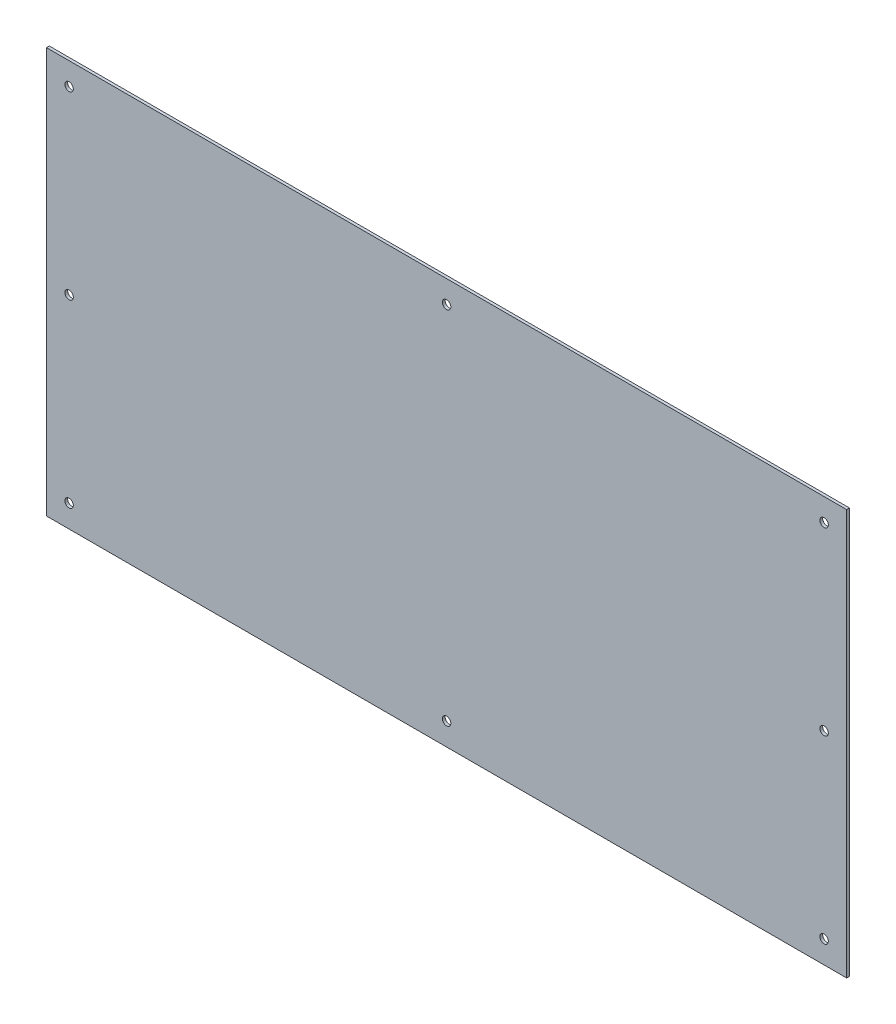
ISO-10303-21;
HEADER;
FILE_DESCRIPTION(('STEP AP214'),'2;1');
FILE_NAME('part.step','',(''),(''),'','','');
FILE_SCHEMA(('AUTOMOTIVE_DESIGN { 1 0 10303 214 1 1 1 1 }'));
ENDSEC;
DATA;
#1=APPLICATION_CONTEXT('core data for automotive mechanical design processes');
#2=APPLICATION_PROTOCOL_DEFINITION('international standard','automotive_design',2000,#1);
#3=PRODUCT_CONTEXT('',#1,'mechanical');
#4=PRODUCT('Part','Part','',(#3));
#5=PRODUCT_RELATED_PRODUCT_CATEGORY('part','',(#4));
#6=PRODUCT_DEFINITION_FORMATION('','',#4);
#7=PRODUCT_DEFINITION_CONTEXT('part definition',#1,'design');
#8=PRODUCT_DEFINITION('design','',#6,#7);
#9=PRODUCT_DEFINITION_SHAPE('','',#8);
#10=(LENGTH_UNIT() NAMED_UNIT(*) SI_UNIT(.MILLI.,.METRE.));
#11=(NAMED_UNIT(*) PLANE_ANGLE_UNIT() SI_UNIT($,.RADIAN.));
#12=(NAMED_UNIT(*) SI_UNIT($,.STERADIAN.) SOLID_ANGLE_UNIT());
#13=UNCERTAINTY_MEASURE_WITH_UNIT(LENGTH_MEASURE(1.E-05),#10,'distance_accuracy_value','');
#14=(GEOMETRIC_REPRESENTATION_CONTEXT(3) GLOBAL_UNCERTAINTY_ASSIGNED_CONTEXT((#13)) GLOBAL_UNIT_ASSIGNED_CONTEXT((#10,
#11,#12)) REPRESENTATION_CONTEXT('',''));
#15=CARTESIAN_POINT('',(0.,0.,0.));
#16=DIRECTION('',(0.,0.,1.));
#17=DIRECTION('',(1.,0.,0.));
#18=AXIS2_PLACEMENT_3D('',#15,#16,#17);
#19=CARTESIAN_POINT('',(0.,0.,3.175));
#20=DIRECTION('',(0.,0.,1.));
#21=DIRECTION('',(1.,0.,0.));
#22=AXIS2_PLACEMENT_3D('',#19,#20,#21);
#23=PLANE('',#22);
#24=CARTESIAN_POINT('',(425.45,203.2,3.175));
#25=DIRECTION('',(0.,0.,1.));
#26=DIRECTION('',(1.,0.,0.));
#27=AXIS2_PLACEMENT_3D('',#24,#25,#26);
#28=CIRCLE('',#27,4.7625);
#29=CARTESIAN_POINT('',(430.2125,203.2,3.175));
#30=VERTEX_POINT('',#29);
#31=EDGE_CURVE('E104',#30,#30,#28,.F.);
#32=ORIENTED_EDGE('',*,*,#31,.T.);
#33=EDGE_LOOP('',(#32));
#34=FACE_BOUND('',#33,.T.);
#35=CARTESIAN_POINT('',(425.45,0.,3.175));
#36=DIRECTION('',(0.,0.,1.));
#37=DIRECTION('',(1.,0.,0.));
#38=AXIS2_PLACEMENT_3D('',#35,#36,#37);
#39=CIRCLE('',#38,4.7625);
#40=CARTESIAN_POINT('',(430.2125,0.,3.175));
#41=VERTEX_POINT('',#40);
#42=EDGE_CURVE('E107',#41,#41,#39,.F.);
#43=ORIENTED_EDGE('',*,*,#42,.T.);
#44=EDGE_LOOP('',(#43));
#45=FACE_BOUND('',#44,.T.);
#46=CARTESIAN_POINT('',(425.45,-203.2,3.175));
#47=DIRECTION('',(0.,0.,1.));
#48=DIRECTION('',(1.,0.,0.));
#49=AXIS2_PLACEMENT_3D('',#46,#47,#48);
#50=CIRCLE('',#49,4.7625);
#51=CARTESIAN_POINT('',(430.2125,-203.2,3.175));
#52=VERTEX_POINT('',#51);
#53=EDGE_CURVE('E110',#52,#52,#50,.F.);
#54=ORIENTED_EDGE('',*,*,#53,.T.);
#55=EDGE_LOOP('',(#54));
#56=FACE_BOUND('',#55,.T.);
#57=CARTESIAN_POINT('',(0.,-203.2,3.175));
#58=DIRECTION('',(0.,0.,1.));
#59=DIRECTION('',(1.,0.,0.));
#60=AXIS2_PLACEMENT_3D('',#57,#58,#59);
#61=CIRCLE('',#60,4.7625);
#62=CARTESIAN_POINT('',(4.7625,-203.2,3.175));
#63=VERTEX_POINT('',#62);
#64=EDGE_CURVE('E113',#63,#63,#61,.F.);
#65=ORIENTED_EDGE('',*,*,#64,.T.);
#66=EDGE_LOOP('',(#65));
#67=FACE_BOUND('',#66,.T.);
#68=CARTESIAN_POINT('',(0.,203.2,3.175));
#69=DIRECTION('',(0.,0.,-1.));
#70=DIRECTION('',(-1.,0.,0.));
#71=AXIS2_PLACEMENT_3D('',#68,#69,#70);
#72=CIRCLE('',#71,4.7625);
#73=CARTESIAN_POINT('',(-4.7625,203.2,3.175));
#74=VERTEX_POINT('',#73);
#75=EDGE_CURVE('E116',#74,#74,#72,.T.);
#76=ORIENTED_EDGE('',*,*,#75,.T.);
#77=EDGE_LOOP('',(#76));
#78=FACE_BOUND('',#77,.T.);
#79=CARTESIAN_POINT('',(-425.45,203.2,3.175));
#80=DIRECTION('',(0.,0.,-1.));
#81=DIRECTION('',(-1.,0.,0.));
#82=AXIS2_PLACEMENT_3D('',#79,#80,#81);
#83=CIRCLE('',#82,4.7625);
#84=CARTESIAN_POINT('',(-430.2125,203.2,3.175));
#85=VERTEX_POINT('',#84);
#86=EDGE_CURVE('E119',#85,#85,#83,.T.);
#87=ORIENTED_EDGE('',*,*,#86,.T.);
#88=EDGE_LOOP('',(#87));
#89=FACE_BOUND('',#88,.T.);
#90=CARTESIAN_POINT('',(-425.45,0.,3.175));
#91=DIRECTION('',(0.,0.,-1.));
#92=DIRECTION('',(-1.,0.,0.));
#93=AXIS2_PLACEMENT_3D('',#90,#91,#92);
#94=CIRCLE('',#93,4.7625);
#95=CARTESIAN_POINT('',(-430.2125,0.,3.175));
#96=VERTEX_POINT('',#95);
#97=EDGE_CURVE('E121',#96,#96,#94,.T.);
#98=ORIENTED_EDGE('',*,*,#97,.T.);
#99=EDGE_LOOP('',(#98));
#100=FACE_BOUND('',#99,.T.);
#101=CARTESIAN_POINT('',(-425.45,-203.2,3.175));
#102=DIRECTION('',(0.,0.,-1.));
#103=DIRECTION('',(-1.,0.,0.));
#104=AXIS2_PLACEMENT_3D('',#101,#102,#103);
#105=CIRCLE('',#104,4.7625);
#106=CARTESIAN_POINT('',(-430.2125,-203.2,3.175));
#107=VERTEX_POINT('',#106);
#108=EDGE_CURVE('E20',#107,#107,#105,.T.);
#109=ORIENTED_EDGE('',*,*,#108,.T.);
#110=EDGE_LOOP('',(#109));
#111=FACE_BOUND('',#110,.T.);
#112=DIRECTION('',(1.,0.,0.));
#113=VECTOR('',#112,1.);
#114=CARTESIAN_POINT('',(450.85,228.6,3.175));
#115=LINE('',#114,#113);
#116=CARTESIAN_POINT('',(-450.85,228.6,3.175));
#117=VERTEX_POINT('',#116);
#118=CARTESIAN_POINT('',(450.85,228.6,3.175));
#119=VERTEX_POINT('',#118);
#120=EDGE_CURVE('E71',#117,#119,#115,.T.);
#121=ORIENTED_EDGE('',*,*,#120,.F.);
#122=DIRECTION('',(0.,1.,0.));
#123=VECTOR('',#122,1.);
#124=CARTESIAN_POINT('',(-450.85,228.6,3.175));
#125=LINE('',#124,#123);
#126=CARTESIAN_POINT('',(-450.85,-228.6,3.175));
#127=VERTEX_POINT('',#126);
#128=EDGE_CURVE('E68',#127,#117,#125,.T.);
#129=ORIENTED_EDGE('',*,*,#128,.F.);
#130=DIRECTION('',(1.,0.,0.));
#131=VECTOR('',#130,1.);
#132=CARTESIAN_POINT('',(-450.85,-228.6,3.175));
#133=LINE('',#132,#131);
#134=CARTESIAN_POINT('',(450.85,-228.6,3.175));
#135=VERTEX_POINT('',#134);
#136=EDGE_CURVE('E59',#135,#127,#133,.F.);
#137=ORIENTED_EDGE('',*,*,#136,.F.);
#138=DIRECTION('',(0.,1.,0.));
#139=VECTOR('',#138,1.);
#140=CARTESIAN_POINT('',(450.85,-228.6,3.175));
#141=LINE('',#140,#139);
#142=EDGE_CURVE('E54',#119,#135,#141,.F.);
#143=ORIENTED_EDGE('',*,*,#142,.F.);
#144=EDGE_LOOP('',(#121,#129,#137,#143));
#145=FACE_BOUND('',#144,.T.);
#146=ADVANCED_FACE('F17',(#34,#45,#56,#67,#78,#89,#100,#111,#145),#23,.T.);
#147=CARTESIAN_POINT('',(-450.85,228.6,0.));
#148=DIRECTION('',(-1.,0.,0.));
#149=DIRECTION('',(0.,0.,1.));
#150=AXIS2_PLACEMENT_3D('',#147,#148,#149);
#151=PLANE('',#150);
#152=DIRECTION('',(0.,0.,1.));
#153=VECTOR('',#152,1.);
#154=CARTESIAN_POINT('',(-450.85,228.6,0.));
#155=LINE('',#154,#153);
#156=CARTESIAN_POINT('',(-450.85,228.6,0.));
#157=VERTEX_POINT('',#156);
#158=EDGE_CURVE('E129',#157,#117,#155,.T.);
#159=ORIENTED_EDGE('',*,*,#158,.F.);
#160=DIRECTION('',(0.,1.,0.));
#161=VECTOR('',#160,1.);
#162=CARTESIAN_POINT('',(-450.85,0.,0.));
#163=LINE('',#162,#161);
#164=CARTESIAN_POINT('',(-450.85,-228.6,0.));
#165=VERTEX_POINT('',#164);
#166=EDGE_CURVE('E78',#157,#165,#163,.F.);
#167=ORIENTED_EDGE('',*,*,#166,.T.);
#168=DIRECTION('',(0.,0.,-1.));
#169=VECTOR('',#168,1.);
#170=CARTESIAN_POINT('',(-450.85,-228.6,0.));
#171=LINE('',#170,#169);
#172=EDGE_CURVE('E64',#127,#165,#171,.T.);
#173=ORIENTED_EDGE('',*,*,#172,.F.);
#174=ORIENTED_EDGE('',*,*,#128,.T.);
#175=EDGE_LOOP('',(#159,#167,#173,#174));
#176=FACE_BOUND('',#175,.T.);
#177=ADVANCED_FACE('F77',(#176),#151,.T.);
#178=CARTESIAN_POINT('',(-450.85,-228.6,0.));
#179=DIRECTION('',(0.,-1.,0.));
#180=DIRECTION('',(0.,0.,-1.));
#181=AXIS2_PLACEMENT_3D('',#178,#179,#180);
#182=PLANE('',#181);
#183=ORIENTED_EDGE('',*,*,#172,.T.);
#184=DIRECTION('',(1.,0.,0.));
#185=VECTOR('',#184,1.);
#186=CARTESIAN_POINT('',(0.,-228.6,0.));
#187=LINE('',#186,#185);
#188=CARTESIAN_POINT('',(450.85,-228.6,0.));
#189=VERTEX_POINT('',#188);
#190=EDGE_CURVE('E140',#165,#189,#187,.T.);
#191=ORIENTED_EDGE('',*,*,#190,.T.);
#192=DIRECTION('',(0.,0.,-1.));
#193=VECTOR('',#192,1.);
#194=CARTESIAN_POINT('',(450.85,-228.6,0.));
#195=LINE('',#194,#193);
#196=EDGE_CURVE('E66',#135,#189,#195,.T.);
#197=ORIENTED_EDGE('',*,*,#196,.F.);
#198=ORIENTED_EDGE('',*,*,#136,.T.);
#199=EDGE_LOOP('',(#183,#191,#197,#198));
#200=FACE_BOUND('',#199,.T.);
#201=ADVANCED_FACE('F61',(#200),#182,.T.);
#202=CARTESIAN_POINT('',(450.85,-228.6,0.));
#203=DIRECTION('',(1.,0.,0.));
#204=DIRECTION('',(0.,0.,-1.));
#205=AXIS2_PLACEMENT_3D('',#202,#203,#204);
#206=PLANE('',#205);
#207=ORIENTED_EDGE('',*,*,#196,.T.);
#208=DIRECTION('',(0.,1.,0.));
#209=VECTOR('',#208,1.);
#210=CARTESIAN_POINT('',(450.85,0.,0.));
#211=LINE('',#210,#209);
#212=CARTESIAN_POINT('',(450.85,228.6,0.));
#213=VERTEX_POINT('',#212);
#214=EDGE_CURVE('E137',#189,#213,#211,.T.);
#215=ORIENTED_EDGE('',*,*,#214,.T.);
#216=DIRECTION('',(0.,0.,1.));
#217=VECTOR('',#216,1.);
#218=CARTESIAN_POINT('',(450.85,228.6,0.));
#219=LINE('',#218,#217);
#220=EDGE_CURVE('E35',#119,#213,#219,.F.);
#221=ORIENTED_EDGE('',*,*,#220,.F.);
#222=ORIENTED_EDGE('',*,*,#142,.T.);
#223=EDGE_LOOP('',(#207,#215,#221,#222));
#224=FACE_BOUND('',#223,.T.);
#225=ADVANCED_FACE('F136',(#224),#206,.T.);
#226=CARTESIAN_POINT('',(450.85,228.6,0.));
#227=DIRECTION('',(0.,1.,0.));
#228=DIRECTION('',(0.,0.,1.));
#229=AXIS2_PLACEMENT_3D('',#226,#227,#228);
#230=PLANE('',#229);
#231=ORIENTED_EDGE('',*,*,#220,.T.);
#232=DIRECTION('',(1.,0.,0.));
#233=VECTOR('',#232,1.);
#234=CARTESIAN_POINT('',(0.,228.6,0.));
#235=LINE('',#234,#233);
#236=EDGE_CURVE('E103',#213,#157,#235,.F.);
#237=ORIENTED_EDGE('',*,*,#236,.T.);
#238=ORIENTED_EDGE('',*,*,#158,.T.);
#239=ORIENTED_EDGE('',*,*,#120,.T.);
#240=EDGE_LOOP('',(#231,#237,#238,#239));
#241=FACE_BOUND('',#240,.T.);
#242=ADVANCED_FACE('F143',(#241),#230,.T.);
#243=CARTESIAN_POINT('',(-425.45,-203.2,3.175));
#244=DIRECTION('',(0.,0.,-1.));
#245=DIRECTION('',(-1.,0.,0.));
#246=AXIS2_PLACEMENT_3D('',#243,#244,#245);
#247=CYLINDRICAL_SURFACE('',#246,4.7625);
#248=ORIENTED_EDGE('',*,*,#108,.F.);
#249=EDGE_LOOP('',(#248));
#250=FACE_BOUND('',#249,.T.);
#251=CARTESIAN_POINT('',(-425.45,-203.2,0.));
#252=DIRECTION('',(0.,0.,-1.));
#253=DIRECTION('',(-1.,0.,0.));
#254=AXIS2_PLACEMENT_3D('',#251,#252,#253);
#255=CIRCLE('',#254,4.7625);
#256=CARTESIAN_POINT('',(-430.2125,-203.2,0.));
#257=VERTEX_POINT('',#256);
#258=EDGE_CURVE('E100',#257,#257,#255,.T.);
#259=ORIENTED_EDGE('',*,*,#258,.T.);
#260=EDGE_LOOP('',(#259));
#261=FACE_BOUND('',#260,.T.);
#262=ADVANCED_FACE('F145',(#250,#261),#247,.F.);
#263=CARTESIAN_POINT('',(-425.45,0.,3.175));
#264=DIRECTION('',(0.,0.,-1.));
#265=DIRECTION('',(-1.,0.,0.));
#266=AXIS2_PLACEMENT_3D('',#263,#264,#265);
#267=CYLINDRICAL_SURFACE('',#266,4.7625);
#268=ORIENTED_EDGE('',*,*,#97,.F.);
#269=EDGE_LOOP('',(#268));
#270=FACE_BOUND('',#269,.T.);
#271=CARTESIAN_POINT('',(-425.45,0.,0.));
#272=DIRECTION('',(0.,0.,-1.));
#273=DIRECTION('',(-1.,0.,0.));
#274=AXIS2_PLACEMENT_3D('',#271,#272,#273);
#275=CIRCLE('',#274,4.7625);
#276=CARTESIAN_POINT('',(-430.2125,0.,0.));
#277=VERTEX_POINT('',#276);
#278=EDGE_CURVE('E97',#277,#277,#275,.T.);
#279=ORIENTED_EDGE('',*,*,#278,.T.);
#280=EDGE_LOOP('',(#279));
#281=FACE_BOUND('',#280,.T.);
#282=ADVANCED_FACE('F152',(#270,#281),#267,.F.);
#283=CARTESIAN_POINT('',(-425.45,203.2,3.175));
#284=DIRECTION('',(0.,0.,-1.));
#285=DIRECTION('',(-1.,0.,0.));
#286=AXIS2_PLACEMENT_3D('',#283,#284,#285);
#287=CYLINDRICAL_SURFACE('',#286,4.7625);
#288=ORIENTED_EDGE('',*,*,#86,.F.);
#289=EDGE_LOOP('',(#288));
#290=FACE_BOUND('',#289,.T.);
#291=CARTESIAN_POINT('',(-425.45,203.2,0.));
#292=DIRECTION('',(0.,0.,-1.));
#293=DIRECTION('',(-1.,0.,0.));
#294=AXIS2_PLACEMENT_3D('',#291,#292,#293);
#295=CIRCLE('',#294,4.7625);
#296=CARTESIAN_POINT('',(-430.2125,203.2,0.));
#297=VERTEX_POINT('',#296);
#298=EDGE_CURVE('E94',#297,#297,#295,.T.);
#299=ORIENTED_EDGE('',*,*,#298,.T.);
#300=EDGE_LOOP('',(#299));
#301=FACE_BOUND('',#300,.T.);
#302=ADVANCED_FACE('F183',(#290,#301),#287,.F.);
#303=CARTESIAN_POINT('',(0.,203.2,3.175));
#304=DIRECTION('',(0.,0.,-1.));
#305=DIRECTION('',(-1.,0.,0.));
#306=AXIS2_PLACEMENT_3D('',#303,#304,#305);
#307=CYLINDRICAL_SURFACE('',#306,4.7625);
#308=ORIENTED_EDGE('',*,*,#75,.F.);
#309=EDGE_LOOP('',(#308));
#310=FACE_BOUND('',#309,.T.);
#311=CARTESIAN_POINT('',(0.,203.2,0.));
#312=DIRECTION('',(0.,0.,-1.));
#313=DIRECTION('',(-1.,0.,0.));
#314=AXIS2_PLACEMENT_3D('',#311,#312,#313);
#315=CIRCLE('',#314,4.7625);
#316=CARTESIAN_POINT('',(-4.7625,203.2,0.));
#317=VERTEX_POINT('',#316);
#318=EDGE_CURVE('E91',#317,#317,#315,.T.);
#319=ORIENTED_EDGE('',*,*,#318,.T.);
#320=EDGE_LOOP('',(#319));
#321=FACE_BOUND('',#320,.T.);
#322=ADVANCED_FACE('F179',(#310,#321),#307,.F.);
#323=CARTESIAN_POINT('',(0.,-203.2,3.175));
#324=DIRECTION('',(0.,0.,1.));
#325=DIRECTION('',(1.,0.,0.));
#326=AXIS2_PLACEMENT_3D('',#323,#324,#325);
#327=CYLINDRICAL_SURFACE('',#326,4.7625);
#328=ORIENTED_EDGE('',*,*,#64,.F.);
#329=EDGE_LOOP('',(#328));
#330=FACE_BOUND('',#329,.T.);
#331=CARTESIAN_POINT('',(0.,-203.2,0.));
#332=DIRECTION('',(0.,0.,1.));
#333=DIRECTION('',(1.,0.,0.));
#334=AXIS2_PLACEMENT_3D('',#331,#332,#333);
#335=CIRCLE('',#334,4.7625);
#336=CARTESIAN_POINT('',(4.7625,-203.2,0.));
#337=VERTEX_POINT('',#336);
#338=EDGE_CURVE('E88',#337,#337,#335,.F.);
#339=ORIENTED_EDGE('',*,*,#338,.T.);
#340=EDGE_LOOP('',(#339));
#341=FACE_BOUND('',#340,.T.);
#342=ADVANCED_FACE('F175',(#330,#341),#327,.F.);
#343=CARTESIAN_POINT('',(425.45,-203.2,3.175));
#344=DIRECTION('',(0.,0.,1.));
#345=DIRECTION('',(1.,0.,0.));
#346=AXIS2_PLACEMENT_3D('',#343,#344,#345);
#347=CYLINDRICAL_SURFACE('',#346,4.7625);
#348=ORIENTED_EDGE('',*,*,#53,.F.);
#349=EDGE_LOOP('',(#348));
#350=FACE_BOUND('',#349,.T.);
#351=CARTESIAN_POINT('',(425.45,-203.2,0.));
#352=DIRECTION('',(0.,0.,1.));
#353=DIRECTION('',(1.,0.,0.));
#354=AXIS2_PLACEMENT_3D('',#351,#352,#353);
#355=CIRCLE('',#354,4.7625);
#356=CARTESIAN_POINT('',(430.2125,-203.2,0.));
#357=VERTEX_POINT('',#356);
#358=EDGE_CURVE('E85',#357,#357,#355,.F.);
#359=ORIENTED_EDGE('',*,*,#358,.T.);
#360=EDGE_LOOP('',(#359));
#361=FACE_BOUND('',#360,.T.);
#362=ADVANCED_FACE('F171',(#350,#361),#347,.F.);
#363=CARTESIAN_POINT('',(425.45,0.,3.175));
#364=DIRECTION('',(0.,0.,1.));
#365=DIRECTION('',(1.,0.,0.));
#366=AXIS2_PLACEMENT_3D('',#363,#364,#365);
#367=CYLINDRICAL_SURFACE('',#366,4.7625);
#368=ORIENTED_EDGE('',*,*,#42,.F.);
#369=EDGE_LOOP('',(#368));
#370=FACE_BOUND('',#369,.T.);
#371=CARTESIAN_POINT('',(425.45,0.,0.));
#372=DIRECTION('',(0.,0.,1.));
#373=DIRECTION('',(1.,0.,0.));
#374=AXIS2_PLACEMENT_3D('',#371,#372,#373);
#375=CIRCLE('',#374,4.7625);
#376=CARTESIAN_POINT('',(430.2125,0.,0.));
#377=VERTEX_POINT('',#376);
#378=EDGE_CURVE('E26',#377,#377,#375,.F.);
#379=ORIENTED_EDGE('',*,*,#378,.T.);
#380=EDGE_LOOP('',(#379));
#381=FACE_BOUND('',#380,.T.);
#382=ADVANCED_FACE('F163',(#370,#381),#367,.F.);
#383=CARTESIAN_POINT('',(425.45,203.2,3.175));
#384=DIRECTION('',(0.,0.,1.));
#385=DIRECTION('',(1.,0.,0.));
#386=AXIS2_PLACEMENT_3D('',#383,#384,#385);
#387=CYLINDRICAL_SURFACE('',#386,4.7625);
#388=ORIENTED_EDGE('',*,*,#31,.F.);
#389=EDGE_LOOP('',(#388));
#390=FACE_BOUND('',#389,.T.);
#391=CARTESIAN_POINT('',(425.45,203.2,0.));
#392=DIRECTION('',(0.,0.,1.));
#393=DIRECTION('',(1.,0.,0.));
#394=AXIS2_PLACEMENT_3D('',#391,#392,#393);
#395=CIRCLE('',#394,4.7625);
#396=CARTESIAN_POINT('',(430.2125,203.2,0.));
#397=VERTEX_POINT('',#396);
#398=EDGE_CURVE('E11',#397,#397,#395,.F.);
#399=ORIENTED_EDGE('',*,*,#398,.T.);
#400=EDGE_LOOP('',(#399));
#401=FACE_BOUND('',#400,.T.);
#402=ADVANCED_FACE('F157',(#390,#401),#387,.F.);
#403=CARTESIAN_POINT('',(0.,0.,0.));
#404=DIRECTION('',(0.,0.,1.));
#405=DIRECTION('',(1.,0.,0.));
#406=AXIS2_PLACEMENT_3D('',#403,#404,#405);
#407=PLANE('',#406);
#408=ORIENTED_EDGE('',*,*,#398,.F.);
#409=EDGE_LOOP('',(#408));
#410=FACE_BOUND('',#409,.T.);
#411=ORIENTED_EDGE('',*,*,#378,.F.);
#412=EDGE_LOOP('',(#411));
#413=FACE_BOUND('',#412,.T.);
#414=ORIENTED_EDGE('',*,*,#358,.F.);
#415=EDGE_LOOP('',(#414));
#416=FACE_BOUND('',#415,.T.);
#417=ORIENTED_EDGE('',*,*,#338,.F.);
#418=EDGE_LOOP('',(#417));
#419=FACE_BOUND('',#418,.T.);
#420=ORIENTED_EDGE('',*,*,#318,.F.);
#421=EDGE_LOOP('',(#420));
#422=FACE_BOUND('',#421,.T.);
#423=ORIENTED_EDGE('',*,*,#298,.F.);
#424=EDGE_LOOP('',(#423));
#425=FACE_BOUND('',#424,.T.);
#426=ORIENTED_EDGE('',*,*,#278,.F.);
#427=EDGE_LOOP('',(#426));
#428=FACE_BOUND('',#427,.T.);
#429=ORIENTED_EDGE('',*,*,#258,.F.);
#430=EDGE_LOOP('',(#429));
#431=FACE_BOUND('',#430,.T.);
#432=ORIENTED_EDGE('',*,*,#214,.F.);
#433=ORIENTED_EDGE('',*,*,#190,.F.);
#434=ORIENTED_EDGE('',*,*,#166,.F.);
#435=ORIENTED_EDGE('',*,*,#236,.F.);
#436=EDGE_LOOP('',(#432,#433,#434,#435));
#437=FACE_BOUND('',#436,.T.);
#438=ADVANCED_FACE('F139',(#410,#413,#416,#419,#422,#425,#428,#431,#437),#407,.F.);
#439=CLOSED_SHELL('',(#146,#177,#201,#225,#242,#262,#282,#302,#322,#342,#362,#382,#402,#438));
#440=MANIFOLD_SOLID_BREP('B1',#439);
#441=ADVANCED_BREP_SHAPE_REPRESENTATION('',(#18,#440),#14);
#442=SHAPE_DEFINITION_REPRESENTATION(#9,#441);
ENDSEC;
END-ISO-10303-21;
